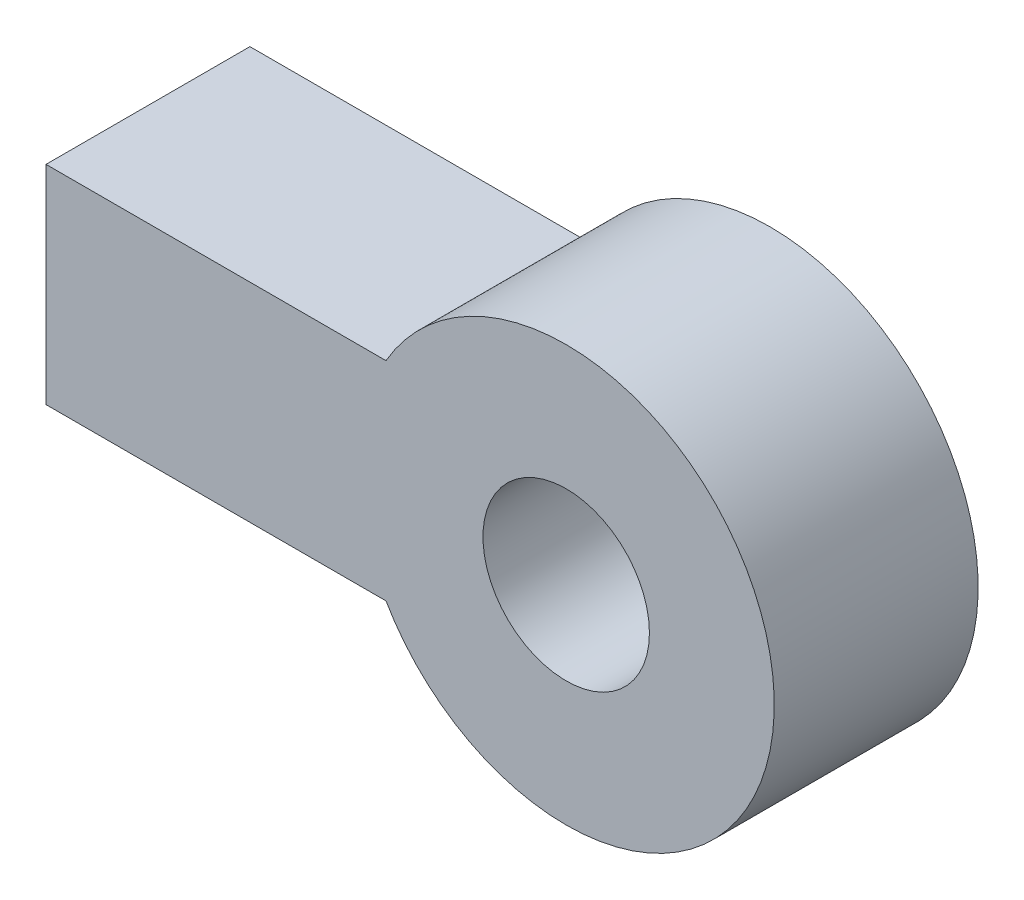
ISO-10303-21;
HEADER;
FILE_DESCRIPTION(('STEP AP214'),'2;1');
FILE_NAME('part.step','',(''),(''),'','','');
FILE_SCHEMA(('AUTOMOTIVE_DESIGN { 1 0 10303 214 1 1 1 1 }'));
ENDSEC;
DATA;
#1=APPLICATION_CONTEXT('core data for automotive mechanical design processes');
#2=APPLICATION_PROTOCOL_DEFINITION('international standard','automotive_design',2000,#1);
#3=PRODUCT_CONTEXT('',#1,'mechanical');
#4=PRODUCT('Part','Part','',(#3));
#5=PRODUCT_RELATED_PRODUCT_CATEGORY('part','',(#4));
#6=PRODUCT_DEFINITION_FORMATION('','',#4);
#7=PRODUCT_DEFINITION_CONTEXT('part definition',#1,'design');
#8=PRODUCT_DEFINITION('design','',#6,#7);
#9=PRODUCT_DEFINITION_SHAPE('','',#8);
#10=(LENGTH_UNIT() NAMED_UNIT(*) SI_UNIT(.MILLI.,.METRE.));
#11=(NAMED_UNIT(*) PLANE_ANGLE_UNIT() SI_UNIT($,.RADIAN.));
#12=(NAMED_UNIT(*) SI_UNIT($,.STERADIAN.) SOLID_ANGLE_UNIT());
#13=UNCERTAINTY_MEASURE_WITH_UNIT(LENGTH_MEASURE(1.E-05),#10,'distance_accuracy_value','');
#14=(GEOMETRIC_REPRESENTATION_CONTEXT(3) GLOBAL_UNCERTAINTY_ASSIGNED_CONTEXT((#13)) GLOBAL_UNIT_ASSIGNED_CONTEXT((#10,
#11,#12)) REPRESENTATION_CONTEXT('',''));
#15=CARTESIAN_POINT('',(0.,0.,0.));
#16=DIRECTION('',(0.,0.,1.));
#17=DIRECTION('',(1.,0.,0.));
#18=AXIS2_PLACEMENT_3D('',#15,#16,#17);
#19=CARTESIAN_POINT('',(0.,0.,12.446));
#20=DIRECTION('',(0.,0.,-1.));
#21=DIRECTION('',(-1.,0.,0.));
#22=AXIS2_PLACEMENT_3D('',#19,#20,#21);
#23=CYLINDRICAL_SURFACE('',#22,2.54);
#24=CARTESIAN_POINT('',(0.,0.,0.));
#25=DIRECTION('',(0.,0.,-1.));
#26=DIRECTION('',(-1.,0.,0.));
#27=AXIS2_PLACEMENT_3D('',#24,#25,#26);
#28=CIRCLE('',#27,2.54);
#29=CARTESIAN_POINT('',(-2.54,0.,0.));
#30=VERTEX_POINT('',#29);
#31=EDGE_CURVE('E106',#30,#30,#28,.T.);
#32=ORIENTED_EDGE('',*,*,#31,.T.);
#33=EDGE_LOOP('',(#32));
#34=FACE_BOUND('',#33,.T.);
#35=CARTESIAN_POINT('',(0.,0.,2.286));
#36=DIRECTION('',(0.,0.,1.));
#37=DIRECTION('',(1.,0.,0.));
#38=AXIS2_PLACEMENT_3D('',#35,#36,#37);
#39=CIRCLE('',#38,2.54);
#40=CARTESIAN_POINT('',(2.54,0.,2.286));
#41=VERTEX_POINT('',#40);
#42=EDGE_CURVE('E37',#41,#41,#39,.F.);
#43=ORIENTED_EDGE('',*,*,#42,.F.);
#44=EDGE_LOOP('',(#43));
#45=FACE_BOUND('',#44,.T.);
#46=ADVANCED_FACE('F33',(#34,#45),#23,.F.);
#47=CARTESIAN_POINT('',(-31.75,-6.35,12.446));
#48=DIRECTION('',(-1.,0.,0.));
#49=DIRECTION('',(0.,0.,1.));
#50=AXIS2_PLACEMENT_3D('',#47,#48,#49);
#51=PLANE('',#50);
#52=DIRECTION('',(0.,1.,0.));
#53=VECTOR('',#52,1.);
#54=CARTESIAN_POINT('',(-31.75,-6.35,0.));
#55=LINE('',#54,#53);
#56=CARTESIAN_POINT('',(-31.75,-6.35,0.));
#57=VERTEX_POINT('',#56);
#58=CARTESIAN_POINT('',(-31.75,6.35,0.));
#59=VERTEX_POINT('',#58);
#60=EDGE_CURVE('E103',#57,#59,#55,.T.);
#61=ORIENTED_EDGE('',*,*,#60,.F.);
#62=DIRECTION('',(0.,0.,-1.));
#63=VECTOR('',#62,1.);
#64=CARTESIAN_POINT('',(-31.75,-6.35,12.446));
#65=LINE('',#64,#63);
#66=CARTESIAN_POINT('',(-31.75,-6.35,12.446));
#67=VERTEX_POINT('',#66);
#68=EDGE_CURVE('E11',#67,#57,#65,.T.);
#69=ORIENTED_EDGE('',*,*,#68,.F.);
#70=DIRECTION('',(0.,1.,0.));
#71=VECTOR('',#70,1.);
#72=CARTESIAN_POINT('',(-31.75,-6.35,12.446));
#73=LINE('',#72,#71);
#74=CARTESIAN_POINT('',(-31.75,6.35,12.446));
#75=VERTEX_POINT('',#74);
#76=EDGE_CURVE('E86',#67,#75,#73,.T.);
#77=ORIENTED_EDGE('',*,*,#76,.T.);
#78=DIRECTION('',(0.,0.,-1.));
#79=VECTOR('',#78,1.);
#80=CARTESIAN_POINT('',(-31.75,6.35,12.446));
#81=LINE('',#80,#79);
#82=EDGE_CURVE('E74',#75,#59,#81,.T.);
#83=ORIENTED_EDGE('',*,*,#82,.T.);
#84=EDGE_LOOP('',(#61,#69,#77,#83));
#85=FACE_BOUND('',#84,.T.);
#86=ADVANCED_FACE('F35',(#85),#51,.T.);
#87=CARTESIAN_POINT('',(-19.05,-6.35,12.446));
#88=DIRECTION('',(0.,-1.,0.));
#89=DIRECTION('',(0.,0.,-1.));
#90=AXIS2_PLACEMENT_3D('',#87,#88,#89);
#91=PLANE('',#90);
#92=DIRECTION('',(-1.,0.,0.));
#93=VECTOR('',#92,1.);
#94=CARTESIAN_POINT('',(-19.05,-6.35,0.));
#95=LINE('',#94,#93);
#96=CARTESIAN_POINT('',(-10.9985226280624,-6.35,0.));
#97=VERTEX_POINT('',#96);
#98=EDGE_CURVE('E65',#97,#57,#95,.T.);
#99=ORIENTED_EDGE('',*,*,#98,.F.);
#100=DIRECTION('',(0.,0.,-1.));
#101=VECTOR('',#100,1.);
#102=CARTESIAN_POINT('',(-10.9985226280624,-6.35,12.446));
#103=LINE('',#102,#101);
#104=CARTESIAN_POINT('',(-10.9985226280624,-6.35,12.446));
#105=VERTEX_POINT('',#104);
#106=EDGE_CURVE('E43',#105,#97,#103,.T.);
#107=ORIENTED_EDGE('',*,*,#106,.F.);
#108=DIRECTION('',(-1.,0.,0.));
#109=VECTOR('',#108,1.);
#110=CARTESIAN_POINT('',(-10.9985226280624,-6.35,12.446));
#111=LINE('',#110,#109);
#112=EDGE_CURVE('E51',#105,#67,#111,.T.);
#113=ORIENTED_EDGE('',*,*,#112,.T.);
#114=ORIENTED_EDGE('',*,*,#68,.T.);
#115=EDGE_LOOP('',(#99,#107,#113,#114));
#116=FACE_BOUND('',#115,.T.);
#117=ADVANCED_FACE('F129',(#116),#91,.T.);
#118=CARTESIAN_POINT('',(0.,0.,12.446));
#119=DIRECTION('',(0.,0.,-1.));
#120=DIRECTION('',(-1.,0.,0.));
#121=AXIS2_PLACEMENT_3D('',#118,#119,#120);
#122=CYLINDRICAL_SURFACE('',#121,12.7);
#123=CARTESIAN_POINT('',(0.,0.,0.));
#124=DIRECTION('',(0.,0.,1.));
#125=DIRECTION('',(1.,0.,0.));
#126=AXIS2_PLACEMENT_3D('',#123,#124,#125);
#127=CIRCLE('',#126,12.7);
#128=CARTESIAN_POINT('',(-10.9985226280624,6.35,0.));
#129=VERTEX_POINT('',#128);
#130=EDGE_CURVE('E94',#97,#129,#127,.T.);
#131=ORIENTED_EDGE('',*,*,#130,.T.);
#132=DIRECTION('',(0.,0.,-1.));
#133=VECTOR('',#132,1.);
#134=CARTESIAN_POINT('',(-10.9985226280624,6.35,12.446));
#135=LINE('',#134,#133);
#136=CARTESIAN_POINT('',(-10.9985226280624,6.35,12.446));
#137=VERTEX_POINT('',#136);
#138=EDGE_CURVE('E80',#137,#129,#135,.T.);
#139=ORIENTED_EDGE('',*,*,#138,.F.);
#140=CARTESIAN_POINT('',(0.,0.,12.446));
#141=DIRECTION('',(0.,0.,1.));
#142=DIRECTION('',(1.,0.,0.));
#143=AXIS2_PLACEMENT_3D('',#140,#141,#142);
#144=CIRCLE('',#143,12.7);
#145=EDGE_CURVE('E85',#105,#137,#144,.T.);
#146=ORIENTED_EDGE('',*,*,#145,.F.);
#147=ORIENTED_EDGE('',*,*,#106,.T.);
#148=EDGE_LOOP('',(#131,#139,#146,#147));
#149=FACE_BOUND('',#148,.T.);
#150=ADVANCED_FACE('F92',(#149),#122,.T.);
#151=CARTESIAN_POINT('',(-19.05,6.35,12.446));
#152=DIRECTION('',(0.,1.,0.));
#153=DIRECTION('',(-1.,0.,0.));
#154=AXIS2_PLACEMENT_3D('',#151,#152,#153);
#155=PLANE('',#154);
#156=DIRECTION('',(1.,0.,0.));
#157=VECTOR('',#156,1.);
#158=CARTESIAN_POINT('',(-19.05,6.35,0.));
#159=LINE('',#158,#157);
#160=EDGE_CURVE('E101',#59,#129,#159,.T.);
#161=ORIENTED_EDGE('',*,*,#160,.F.);
#162=ORIENTED_EDGE('',*,*,#82,.F.);
#163=DIRECTION('',(1.,0.,0.));
#164=VECTOR('',#163,1.);
#165=CARTESIAN_POINT('',(-31.75,6.35,12.446));
#166=LINE('',#165,#164);
#167=EDGE_CURVE('E76',#75,#137,#166,.T.);
#168=ORIENTED_EDGE('',*,*,#167,.T.);
#169=ORIENTED_EDGE('',*,*,#138,.T.);
#170=EDGE_LOOP('',(#161,#162,#168,#169));
#171=FACE_BOUND('',#170,.T.);
#172=ADVANCED_FACE('F78',(#171),#155,.T.);
#173=CARTESIAN_POINT('',(0.,0.,12.446));
#174=DIRECTION('',(0.,0.,1.));
#175=DIRECTION('',(1.,0.,0.));
#176=AXIS2_PLACEMENT_3D('',#173,#174,#175);
#177=PLANE('',#176);
#178=CARTESIAN_POINT('',(0.,0.,12.446));
#179=DIRECTION('',(0.,0.,1.));
#180=DIRECTION('',(1.,0.,0.));
#181=AXIS2_PLACEMENT_3D('',#178,#179,#180);
#182=CIRCLE('',#181,5.08);
#183=CARTESIAN_POINT('',(5.08,0.,12.446));
#184=VERTEX_POINT('',#183);
#185=EDGE_CURVE('E111',#184,#184,#182,.T.);
#186=ORIENTED_EDGE('',*,*,#185,.F.);
#187=EDGE_LOOP('',(#186));
#188=FACE_BOUND('',#187,.T.);
#189=ORIENTED_EDGE('',*,*,#76,.F.);
#190=ORIENTED_EDGE('',*,*,#112,.F.);
#191=ORIENTED_EDGE('',*,*,#145,.T.);
#192=ORIENTED_EDGE('',*,*,#167,.F.);
#193=EDGE_LOOP('',(#189,#190,#191,#192));
#194=FACE_BOUND('',#193,.T.);
#195=ADVANCED_FACE('F89',(#188,#194),#177,.T.);
#196=CARTESIAN_POINT('',(0.,0.,0.));
#197=DIRECTION('',(0.,0.,1.));
#198=DIRECTION('',(1.,0.,0.));
#199=AXIS2_PLACEMENT_3D('',#196,#197,#198);
#200=PLANE('',#199);
#201=ORIENTED_EDGE('',*,*,#31,.F.);
#202=EDGE_LOOP('',(#201));
#203=FACE_BOUND('',#202,.T.);
#204=ORIENTED_EDGE('',*,*,#60,.T.);
#205=ORIENTED_EDGE('',*,*,#160,.T.);
#206=ORIENTED_EDGE('',*,*,#130,.F.);
#207=ORIENTED_EDGE('',*,*,#98,.T.);
#208=EDGE_LOOP('',(#204,#205,#206,#207));
#209=FACE_BOUND('',#208,.T.);
#210=ADVANCED_FACE('F137',(#203,#209),#200,.F.);
#211=CARTESIAN_POINT('',(0.,0.,2.286));
#212=DIRECTION('',(0.,0.,1.));
#213=DIRECTION('',(1.,0.,0.));
#214=AXIS2_PLACEMENT_3D('',#211,#212,#213);
#215=PLANE('',#214);
#216=CARTESIAN_POINT('',(0.,0.,2.286));
#217=DIRECTION('',(0.,0.,1.));
#218=DIRECTION('',(1.,0.,0.));
#219=AXIS2_PLACEMENT_3D('',#216,#217,#218);
#220=CIRCLE('',#219,5.08);
#221=CARTESIAN_POINT('',(5.08,0.,2.286));
#222=VERTEX_POINT('',#221);
#223=EDGE_CURVE('E114',#222,#222,#220,.T.);
#224=ORIENTED_EDGE('',*,*,#223,.T.);
#225=EDGE_LOOP('',(#224));
#226=FACE_BOUND('',#225,.T.);
#227=ORIENTED_EDGE('',*,*,#42,.T.);
#228=EDGE_LOOP('',(#227));
#229=FACE_BOUND('',#228,.T.);
#230=ADVANCED_FACE('F121',(#226,#229),#215,.T.);
#231=CARTESIAN_POINT('',(0.,0.,2.286));
#232=DIRECTION('',(0.,0.,1.));
#233=DIRECTION('',(1.,0.,0.));
#234=AXIS2_PLACEMENT_3D('',#231,#232,#233);
#235=CYLINDRICAL_SURFACE('',#234,5.08);
#236=ORIENTED_EDGE('',*,*,#223,.F.);
#237=EDGE_LOOP('',(#236));
#238=FACE_BOUND('',#237,.T.);
#239=ORIENTED_EDGE('',*,*,#185,.T.);
#240=EDGE_LOOP('',(#239));
#241=FACE_BOUND('',#240,.T.);
#242=ADVANCED_FACE('F133',(#238,#241),#235,.F.);
#243=CLOSED_SHELL('',(#46,#86,#117,#150,#172,#195,#210,#230,#242));
#244=MANIFOLD_SOLID_BREP('B2',#243);
#245=ADVANCED_BREP_SHAPE_REPRESENTATION('',(#18,#244),#14);
#246=SHAPE_DEFINITION_REPRESENTATION(#9,#245);
ENDSEC;
END-ISO-10303-21;
